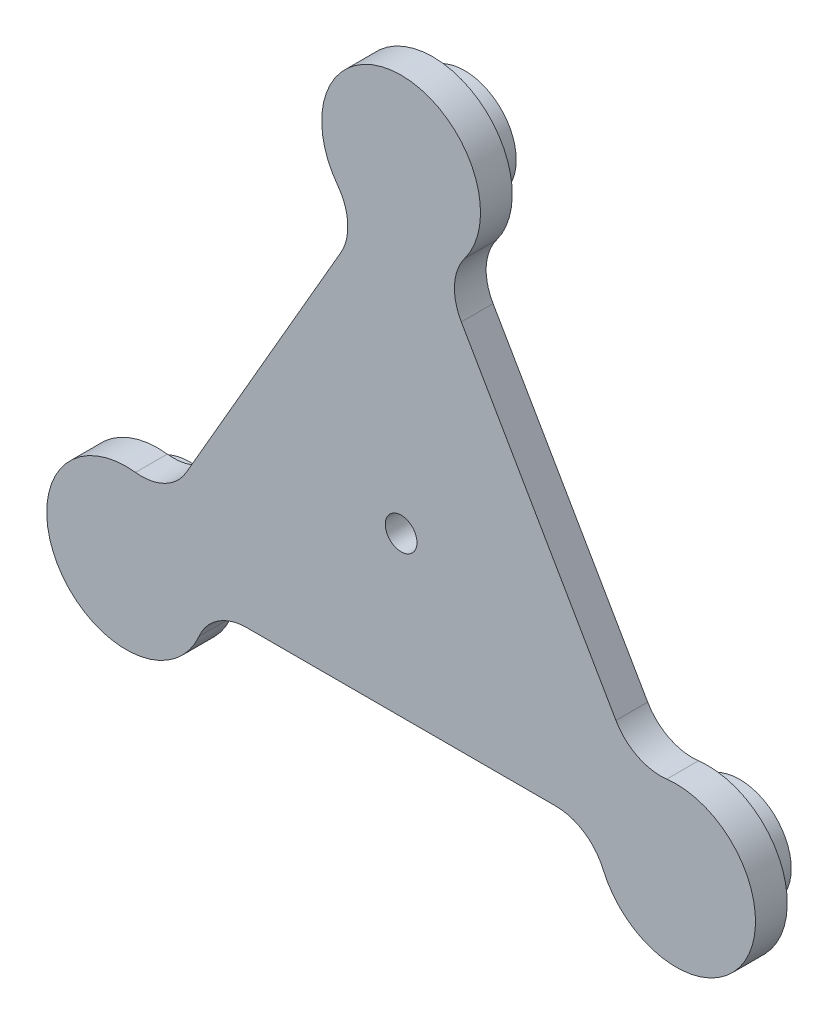
ISO-10303-21;
HEADER;
FILE_DESCRIPTION(('STEP AP214'),'2;1');
FILE_NAME('part.step','',(''),(''),'','','');
FILE_SCHEMA(('AUTOMOTIVE_DESIGN { 1 0 10303 214 1 1 1 1 }'));
ENDSEC;
DATA;
#1=APPLICATION_CONTEXT('core data for automotive mechanical design processes');
#2=APPLICATION_PROTOCOL_DEFINITION('international standard','automotive_design',2000,#1);
#3=PRODUCT_CONTEXT('',#1,'mechanical');
#4=PRODUCT('Part','Part','',(#3));
#5=PRODUCT_RELATED_PRODUCT_CATEGORY('part','',(#4));
#6=PRODUCT_DEFINITION_FORMATION('','',#4);
#7=PRODUCT_DEFINITION_CONTEXT('part definition',#1,'design');
#8=PRODUCT_DEFINITION('design','',#6,#7);
#9=PRODUCT_DEFINITION_SHAPE('','',#8);
#10=(LENGTH_UNIT() NAMED_UNIT(*) SI_UNIT(.MILLI.,.METRE.));
#11=(NAMED_UNIT(*) PLANE_ANGLE_UNIT() SI_UNIT($,.RADIAN.));
#12=(NAMED_UNIT(*) SI_UNIT($,.STERADIAN.) SOLID_ANGLE_UNIT());
#13=UNCERTAINTY_MEASURE_WITH_UNIT(LENGTH_MEASURE(1.E-05),#10,'distance_accuracy_value','');
#14=(GEOMETRIC_REPRESENTATION_CONTEXT(3) GLOBAL_UNCERTAINTY_ASSIGNED_CONTEXT((#13)) GLOBAL_UNIT_ASSIGNED_CONTEXT((#10,
#11,#12)) REPRESENTATION_CONTEXT('',''));
#15=CARTESIAN_POINT('',(0.,0.,0.));
#16=DIRECTION('',(0.,0.,1.));
#17=DIRECTION('',(1.,0.,0.));
#18=AXIS2_PLACEMENT_3D('',#15,#16,#17);
#19=CARTESIAN_POINT('',(33.0301166221257,75.290144521312,-10.));
#20=DIRECTION('',(0.,0.,1.));
#21=DIRECTION('',(1.,0.,0.));
#22=AXIS2_PLACEMENT_3D('',#19,#20,#21);
#23=CYLINDRICAL_SURFACE('',#22,16.2500000000001);
#24=CARTESIAN_POINT('',(33.0301166221257,75.290144521312,0.));
#25=DIRECTION('',(0.,0.,1.));
#26=DIRECTION('',(1.,0.,0.));
#27=AXIS2_PLACEMENT_3D('',#24,#25,#26);
#28=CIRCLE('',#27,16.2500000000001);
#29=CARTESIAN_POINT('',(20.0182604515873,85.0243162373454,0.));
#30=VERTEX_POINT('',#29);
#31=CARTESIAN_POINT('',(18.9572021702539,67.1651473625248,0.));
#32=VERTEX_POINT('',#31);
#33=EDGE_CURVE('E152',#30,#32,#28,.T.);
#34=ORIENTED_EDGE('',*,*,#33,.T.);
#35=DIRECTION('',(0.,0.,1.));
#36=VECTOR('',#35,1.);
#37=CARTESIAN_POINT('',(18.9572021702539,67.1651473625248,-10.));
#38=LINE('',#37,#36);
#39=CARTESIAN_POINT('',(18.9572021702539,67.1651473625248,-10.));
#40=VERTEX_POINT('',#39);
#41=EDGE_CURVE('E201',#40,#32,#38,.T.);
#42=ORIENTED_EDGE('',*,*,#41,.F.);
#43=CARTESIAN_POINT('',(33.0301166221257,75.290144521312,-10.));
#44=DIRECTION('',(0.,0.,1.));
#45=DIRECTION('',(1.,0.,0.));
#46=AXIS2_PLACEMENT_3D('',#43,#44,#45);
#47=CIRCLE('',#46,16.2500000000001);
#48=CARTESIAN_POINT('',(20.0182604515873,85.0243162373454,-10.));
#49=VERTEX_POINT('',#48);
#50=EDGE_CURVE('E180',#49,#40,#47,.T.);
#51=ORIENTED_EDGE('',*,*,#50,.F.);
#52=DIRECTION('',(0.,0.,1.));
#53=VECTOR('',#52,1.);
#54=CARTESIAN_POINT('',(20.0182604515873,85.0243162373454,-10.));
#55=LINE('',#54,#53);
#56=EDGE_CURVE('E148',#49,#30,#55,.T.);
#57=ORIENTED_EDGE('',*,*,#56,.T.);
#58=EDGE_LOOP('',(#34,#42,#51,#57));
#59=FACE_BOUND('',#58,.T.);
#60=ADVANCED_FACE('F32',(#59),#23,.F.);
#61=CARTESIAN_POINT('',(18.9572021702539,67.1651473625248,-10.));
#62=DIRECTION('',(-0.866025504730565,-0.499999825156139,0.));
#63=DIRECTION('',(0.499999825156139,-0.866025504730565,0.));
#64=AXIS2_PLACEMENT_3D('',#61,#62,#63);
#65=PLANE('',#64);
#66=DIRECTION('',(0.499999825156139,-0.866025504730565,0.));
#67=VECTOR('',#66,1.);
#68=CARTESIAN_POINT('',(18.9572021702539,67.1651473625248,0.));
#69=LINE('',#68,#67);
#70=CARTESIAN_POINT('',(67.6453180189673,-17.1651823312806,0.));
#71=VERTEX_POINT('',#70);
#72=EDGE_CURVE('E155',#32,#71,#69,.T.);
#73=ORIENTED_EDGE('',*,*,#72,.T.);
#74=DIRECTION('',(0.,0.,1.));
#75=VECTOR('',#74,1.);
#76=CARTESIAN_POINT('',(67.6453180189673,-17.1651823312806,-10.));
#77=LINE('',#76,#75);
#78=CARTESIAN_POINT('',(67.6453180189673,-17.1651823312806,-10.));
#79=VERTEX_POINT('',#78);
#80=EDGE_CURVE('E199',#79,#71,#77,.T.);
#81=ORIENTED_EDGE('',*,*,#80,.F.);
#82=DIRECTION('',(0.499999825156139,-0.866025504730565,0.));
#83=VECTOR('',#82,1.);
#84=CARTESIAN_POINT('',(18.9572021702539,67.1651473625248,-10.));
#85=LINE('',#84,#83);
#86=EDGE_CURVE('E100',#40,#79,#85,.T.);
#87=ORIENTED_EDGE('',*,*,#86,.F.);
#88=ORIENTED_EDGE('',*,*,#41,.T.);
#89=EDGE_LOOP('',(#73,#81,#87,#88));
#90=FACE_BOUND('',#89,.T.);
#91=ADVANCED_FACE('F233',(#90),#65,.F.);
#92=CARTESIAN_POINT('',(81.7182324708391,-9.04018517249335,-10.));
#93=DIRECTION('',(0.,0.,1.));
#94=DIRECTION('',(1.,0.,0.));
#95=AXIS2_PLACEMENT_3D('',#92,#93,#94);
#96=CYLINDRICAL_SURFACE('',#95,16.2500000000001);
#97=CARTESIAN_POINT('',(81.7182324708391,-9.04018517249335,0.));
#98=DIRECTION('',(0.,0.,-1.));
#99=DIRECTION('',(-1.,0.,0.));
#100=AXIS2_PLACEMENT_3D('',#97,#98,#99);
#101=CIRCLE('',#100,16.2500000000001);
#102=CARTESIAN_POINT('',(83.6423378611152,-25.1758698015109,0.));
#103=VERTEX_POINT('',#102);
#104=EDGE_CURVE('E159',#103,#71,#101,.T.);
#105=ORIENTED_EDGE('',*,*,#104,.F.);
#106=DIRECTION('',(0.,0.,1.));
#107=VECTOR('',#106,1.);
#108=CARTESIAN_POINT('',(83.6423378611152,-25.1758698015109,-10.));
#109=LINE('',#108,#107);
#110=CARTESIAN_POINT('',(83.6423378611152,-25.1758698015109,-10.));
#111=VERTEX_POINT('',#110);
#112=EDGE_CURVE('E197',#111,#103,#109,.T.);
#113=ORIENTED_EDGE('',*,*,#112,.F.);
#114=CARTESIAN_POINT('',(81.7182324708391,-9.04018517249335,-10.));
#115=DIRECTION('',(0.,0.,-1.));
#116=DIRECTION('',(-1.,0.,0.));
#117=AXIS2_PLACEMENT_3D('',#114,#115,#116);
#118=CIRCLE('',#117,16.2500000000001);
#119=EDGE_CURVE('E248',#111,#79,#118,.T.);
#120=ORIENTED_EDGE('',*,*,#119,.T.);
#121=ORIENTED_EDGE('',*,*,#80,.T.);
#122=EDGE_LOOP('',(#105,#113,#120,#121));
#123=FACE_BOUND('',#122,.T.);
#124=ADVANCED_FACE('F238',(#123),#96,.F.);
#125=CARTESIAN_POINT('',(86.6025000000018,-49.9999999999995,-10.));
#126=DIRECTION('',(0.,0.,1.));
#127=DIRECTION('',(1.,0.,0.));
#128=AXIS2_PLACEMENT_3D('',#125,#126,#127);
#129=CYLINDRICAL_SURFACE('',#128,25.0000000000002);
#130=CARTESIAN_POINT('',(86.6025000000018,-49.9999999999995,0.));
#131=DIRECTION('',(0.,0.,-1.));
#132=DIRECTION('',(-1.,0.,0.));
#133=AXIS2_PLACEMENT_3D('',#130,#131,#132);
#134=CIRCLE('',#133,25.0000000000002);
#135=CARTESIAN_POINT('',(63.6240875751492,-59.8484802093207,0.));
#136=VERTEX_POINT('',#135);
#137=EDGE_CURVE('E162',#103,#136,#134,.T.);
#138=ORIENTED_EDGE('',*,*,#137,.T.);
#139=DIRECTION('',(0.,0.,1.));
#140=VECTOR('',#139,1.);
#141=CARTESIAN_POINT('',(63.6240875751492,-59.8484802093207,-10.));
#142=LINE('',#141,#140);
#143=CARTESIAN_POINT('',(63.6240875751492,-59.8484802093207,-10.));
#144=VERTEX_POINT('',#143);
#145=EDGE_CURVE('E194',#144,#136,#142,.T.);
#146=ORIENTED_EDGE('',*,*,#145,.F.);
#147=CARTESIAN_POINT('',(86.6025000000018,-49.9999999999995,-10.));
#148=DIRECTION('',(0.,0.,-1.));
#149=DIRECTION('',(-1.,0.,0.));
#150=AXIS2_PLACEMENT_3D('',#147,#148,#149);
#151=CIRCLE('',#150,25.0000000000002);
#152=EDGE_CURVE('E250',#111,#144,#151,.T.);
#153=ORIENTED_EDGE('',*,*,#152,.F.);
#154=ORIENTED_EDGE('',*,*,#112,.T.);
#155=EDGE_LOOP('',(#138,#146,#153,#154));
#156=FACE_BOUND('',#155,.T.);
#157=ADVANCED_FACE('F288',(#156),#129,.T.);
#158=CARTESIAN_POINT('',(48.6881194989951,-66.2499923453796,-10.));
#159=DIRECTION('',(0.,0.,1.));
#160=DIRECTION('',(1.,0.,0.));
#161=AXIS2_PLACEMENT_3D('',#158,#159,#160);
#162=CYLINDRICAL_SURFACE('',#161,16.2500000000005);
#163=CARTESIAN_POINT('',(48.6881194989951,-66.2499923453796,0.));
#164=DIRECTION('',(0.,0.,1.));
#165=DIRECTION('',(1.,0.,0.));
#166=AXIS2_PLACEMENT_3D('',#163,#164,#165);
#167=CIRCLE('',#166,16.2500000000005);
#168=CARTESIAN_POINT('',(48.6881227797448,-49.9999923453794,0.));
#169=VERTEX_POINT('',#168);
#170=EDGE_CURVE('E164',#136,#169,#167,.T.);
#171=ORIENTED_EDGE('',*,*,#170,.T.);
#172=DIRECTION('',(0.,0.,1.));
#173=VECTOR('',#172,1.);
#174=CARTESIAN_POINT('',(48.6881227797448,-49.9999923453794,-10.));
#175=LINE('',#174,#173);
#176=CARTESIAN_POINT('',(48.6881227797448,-49.9999923453794,-10.));
#177=VERTEX_POINT('',#176);
#178=EDGE_CURVE('E191',#177,#169,#175,.T.);
#179=ORIENTED_EDGE('',*,*,#178,.F.);
#180=CARTESIAN_POINT('',(48.6881194989951,-66.2499923453796,-10.));
#181=DIRECTION('',(0.,0.,1.));
#182=DIRECTION('',(1.,0.,0.));
#183=AXIS2_PLACEMENT_3D('',#180,#181,#182);
#184=CIRCLE('',#183,16.2500000000005);
#185=EDGE_CURVE('E252',#144,#177,#184,.T.);
#186=ORIENTED_EDGE('',*,*,#185,.F.);
#187=ORIENTED_EDGE('',*,*,#145,.T.);
#188=EDGE_LOOP('',(#171,#179,#186,#187));
#189=FACE_BOUND('',#188,.T.);
#190=ADVANCED_FACE('F284',(#189),#162,.F.);
#191=CARTESIAN_POINT('',(48.6881227797448,-49.9999923453791,-10.));
#192=DIRECTION('',(2.01892290155727E-07,0.99999999999998,0.));
#193=DIRECTION('',(-0.99999999999998,2.01892290155727E-07,0.));
#194=AXIS2_PLACEMENT_3D('',#191,#192,#193);
#195=PLANE('',#194);
#196=DIRECTION('',(-0.99999999999998,2.01892290155727E-07,0.));
#197=VECTOR('',#196,1.);
#198=CARTESIAN_POINT('',(48.6881227797448,-49.9999923453791,0.));
#199=LINE('',#198,#197);
#200=CARTESIAN_POINT('',(-48.6881429689648,-49.9999726858618,0.));
#201=VERTEX_POINT('',#200);
#202=EDGE_CURVE('E166',#169,#201,#199,.T.);
#203=ORIENTED_EDGE('',*,*,#202,.T.);
#204=DIRECTION('',(0.,0.,1.));
#205=VECTOR('',#204,1.);
#206=CARTESIAN_POINT('',(-48.6881429689648,-49.9999726858618,-10.));
#207=LINE('',#206,#205);
#208=CARTESIAN_POINT('',(-48.6881429689648,-49.9999726858618,-10.));
#209=VERTEX_POINT('',#208);
#210=EDGE_CURVE('E189',#209,#201,#207,.T.);
#211=ORIENTED_EDGE('',*,*,#210,.F.);
#212=DIRECTION('',(-0.99999999999998,2.01892290155727E-07,0.));
#213=VECTOR('',#212,1.);
#214=CARTESIAN_POINT('',(48.6881227797448,-49.9999923453791,-10.));
#215=LINE('',#214,#213);
#216=EDGE_CURVE('E258',#177,#209,#215,.T.);
#217=ORIENTED_EDGE('',*,*,#216,.F.);
#218=ORIENTED_EDGE('',*,*,#178,.T.);
#219=EDGE_LOOP('',(#203,#211,#217,#218));
#220=FACE_BOUND('',#219,.T.);
#221=ADVANCED_FACE('F280',(#220),#195,.F.);
#222=CARTESIAN_POINT('',(-48.6881462497149,-66.2499726858624,-10.));
#223=DIRECTION('',(0.,0.,1.));
#224=DIRECTION('',(1.,0.,0.));
#225=AXIS2_PLACEMENT_3D('',#222,#223,#224);
#226=CYLINDRICAL_SURFACE('',#225,16.2500000000002);
#227=CARTESIAN_POINT('',(-48.6881462497149,-66.2499726858624,0.));
#228=DIRECTION('',(0.,0.,-1.));
#229=DIRECTION('',(-1.,0.,0.));
#230=AXIS2_PLACEMENT_3D('',#227,#228,#229);
#231=CIRCLE('',#230,16.2500000000002);
#232=CARTESIAN_POINT('',(-63.6241117410363,-59.8484545188911,0.));
#233=VERTEX_POINT('',#232);
#234=EDGE_CURVE('E169',#233,#201,#231,.T.);
#235=ORIENTED_EDGE('',*,*,#234,.F.);
#236=DIRECTION('',(0.,0.,1.));
#237=VECTOR('',#236,1.);
#238=CARTESIAN_POINT('',(-63.6241117410363,-59.8484545188911,-10.));
#239=LINE('',#238,#237);
#240=CARTESIAN_POINT('',(-63.6241117410363,-59.8484545188911,-10.));
#241=VERTEX_POINT('',#240);
#242=EDGE_CURVE('E187',#241,#233,#239,.T.);
#243=ORIENTED_EDGE('',*,*,#242,.F.);
#244=CARTESIAN_POINT('',(-48.6881462497149,-66.2499726858624,-10.));
#245=DIRECTION('',(0.,0.,-1.));
#246=DIRECTION('',(-1.,0.,0.));
#247=AXIS2_PLACEMENT_3D('',#244,#245,#246);
#248=CIRCLE('',#247,16.2500000000002);
#249=EDGE_CURVE('E260',#241,#209,#248,.T.);
#250=ORIENTED_EDGE('',*,*,#249,.T.);
#251=ORIENTED_EDGE('',*,*,#210,.T.);
#252=EDGE_LOOP('',(#235,#243,#250,#251));
#253=FACE_BOUND('',#252,.T.);
#254=ADVANCED_FACE('F276',(#253),#226,.F.);
#255=CARTESIAN_POINT('',(-86.6025201892225,-49.9999650312423,-10.));
#256=DIRECTION('',(0.,0.,1.));
#257=DIRECTION('',(1.,0.,0.));
#258=AXIS2_PLACEMENT_3D('',#255,#256,#257);
#259=CYLINDRICAL_SURFACE('',#258,24.9999999999998);
#260=CARTESIAN_POINT('',(-86.6025201892225,-49.9999650312423,0.));
#261=DIRECTION('',(0.,0.,-1.));
#262=DIRECTION('',(-1.,0.,0.));
#263=AXIS2_PLACEMENT_3D('',#260,#261,#262);
#264=CIRCLE('',#263,24.9999999999998);
#265=CARTESIAN_POINT('',(-83.6423480267364,-25.1758360280238,0.));
#266=VERTEX_POINT('',#265);
#267=EDGE_CURVE('E172',#233,#266,#264,.T.);
#268=ORIENTED_EDGE('',*,*,#267,.T.);
#269=DIRECTION('',(0.,0.,1.));
#270=VECTOR('',#269,1.);
#271=CARTESIAN_POINT('',(-83.6423480267364,-25.1758360280238,-10.));
#272=LINE('',#271,#270);
#273=CARTESIAN_POINT('',(-83.6423480267364,-25.1758360280238,-10.));
#274=VERTEX_POINT('',#273);
#275=EDGE_CURVE('E184',#274,#266,#272,.T.);
#276=ORIENTED_EDGE('',*,*,#275,.F.);
#277=CARTESIAN_POINT('',(-86.6025201892225,-49.9999650312423,-10.));
#278=DIRECTION('',(0.,0.,-1.));
#279=DIRECTION('',(-1.,0.,0.));
#280=AXIS2_PLACEMENT_3D('',#277,#278,#279);
#281=CIRCLE('',#280,24.9999999999998);
#282=EDGE_CURVE('E263',#241,#274,#281,.T.);
#283=ORIENTED_EDGE('',*,*,#282,.F.);
#284=ORIENTED_EDGE('',*,*,#242,.T.);
#285=EDGE_LOOP('',(#268,#276,#283,#284));
#286=FACE_BOUND('',#285,.T.);
#287=ADVANCED_FACE('F268',(#286),#259,.T.);
#288=CARTESIAN_POINT('',(-81.7182361211202,-9.04015217593124,-10.));
#289=DIRECTION('',(0.,0.,1.));
#290=DIRECTION('',(1.,0.,0.));
#291=AXIS2_PLACEMENT_3D('',#288,#289,#290);
#292=CYLINDRICAL_SURFACE('',#291,16.2500000000008);
#293=CARTESIAN_POINT('',(-81.7182361211202,-9.04015217593124,0.));
#294=DIRECTION('',(0.,0.,1.));
#295=DIRECTION('',(1.,0.,0.));
#296=AXIS2_PLACEMENT_3D('',#293,#294,#295);
#297=CIRCLE('',#296,16.2500000000008);
#298=CARTESIAN_POINT('',(-67.6453249499983,-17.1651550171453,0.));
#299=VERTEX_POINT('',#298);
#300=EDGE_CURVE('E174',#266,#299,#297,.T.);
#301=ORIENTED_EDGE('',*,*,#300,.T.);
#302=DIRECTION('',(0.,0.,1.));
#303=VECTOR('',#302,1.);
#304=CARTESIAN_POINT('',(-67.6453249499983,-17.1651550171453,-10.));
#305=LINE('',#304,#303);
#306=CARTESIAN_POINT('',(-67.6453249499983,-17.1651550171453,-10.));
#307=VERTEX_POINT('',#306);
#308=EDGE_CURVE('E144',#307,#299,#305,.T.);
#309=ORIENTED_EDGE('',*,*,#308,.F.);
#310=CARTESIAN_POINT('',(-81.7182361211202,-9.04015217593124,-10.));
#311=DIRECTION('',(0.,0.,1.));
#312=DIRECTION('',(1.,0.,0.));
#313=AXIS2_PLACEMENT_3D('',#310,#311,#312);
#314=CIRCLE('',#313,16.2500000000008);
#315=EDGE_CURVE('E131',#274,#307,#314,.T.);
#316=ORIENTED_EDGE('',*,*,#315,.F.);
#317=ORIENTED_EDGE('',*,*,#275,.T.);
#318=EDGE_LOOP('',(#301,#309,#316,#317));
#319=FACE_BOUND('',#318,.T.);
#320=ADVANCED_FACE('F272',(#319),#292,.F.);
#321=CARTESIAN_POINT('',(-67.6453249499989,-17.165155017145,-10.));
#322=DIRECTION('',(0.866025302838276,-0.500000174843842,0.));
#323=DIRECTION('',(0.500000174843842,0.866025302838276,0.));
#324=AXIS2_PLACEMENT_3D('',#321,#322,#323);
#325=PLANE('',#324);
#326=DIRECTION('',(0.500000174843842,0.866025302838276,0.));
#327=VECTOR('',#326,1.);
#328=CARTESIAN_POINT('',(-67.6453249499989,-17.165155017145,0.));
#329=LINE('',#328,#327);
#330=CARTESIAN_POINT('',(-18.9571750500028,67.1651550171431,0.));
#331=VERTEX_POINT('',#330);
#332=EDGE_CURVE('E140',#299,#331,#329,.T.);
#333=ORIENTED_EDGE('',*,*,#332,.T.);
#334=DIRECTION('',(0.,0.,1.));
#335=VECTOR('',#334,1.);
#336=CARTESIAN_POINT('',(-18.9571750500028,67.1651550171431,-10.));
#337=LINE('',#336,#335);
#338=CARTESIAN_POINT('',(-18.9571750500028,67.1651550171431,-10.));
#339=VERTEX_POINT('',#338);
#340=EDGE_CURVE('E137',#339,#331,#337,.T.);
#341=ORIENTED_EDGE('',*,*,#340,.F.);
#342=DIRECTION('',(0.500000174843842,0.866025302838276,0.));
#343=VECTOR('',#342,1.);
#344=CARTESIAN_POINT('',(-67.6453249499989,-17.165155017145,-10.));
#345=LINE('',#344,#343);
#346=EDGE_CURVE('E125',#307,#339,#345,.T.);
#347=ORIENTED_EDGE('',*,*,#346,.F.);
#348=ORIENTED_EDGE('',*,*,#308,.T.);
#349=EDGE_LOOP('',(#333,#341,#347,#348));
#350=FACE_BOUND('',#349,.T.);
#351=ADVANCED_FACE('F138',(#350),#325,.F.);
#352=CARTESIAN_POINT('',(-33.0300862211249,75.2901578583558,-10.));
#353=DIRECTION('',(0.,0.,1.));
#354=DIRECTION('',(1.,0.,0.));
#355=AXIS2_PLACEMENT_3D('',#352,#353,#354);
#356=CYLINDRICAL_SURFACE('',#355,16.2500000000001);
#357=CARTESIAN_POINT('',(-33.0300862211249,75.2901578583558,0.));
#358=DIRECTION('',(0.,0.,-1.));
#359=DIRECTION('',(-1.,0.,0.));
#360=AXIS2_PLACEMENT_3D('',#357,#358,#359);
#361=CIRCLE('',#360,16.2500000000001);
#362=CARTESIAN_POINT('',(-20.0182261200797,85.0243243204023,0.));
#363=VERTEX_POINT('',#362);
#364=EDGE_CURVE('E177',#363,#331,#361,.T.);
#365=ORIENTED_EDGE('',*,*,#364,.F.);
#366=DIRECTION('',(0.,0.,1.));
#367=VECTOR('',#366,1.);
#368=CARTESIAN_POINT('',(-20.0182261200797,85.0243243204023,-10.));
#369=LINE('',#368,#367);
#370=CARTESIAN_POINT('',(-20.0182261200797,85.0243243204023,-10.));
#371=VERTEX_POINT('',#370);
#372=EDGE_CURVE('E88',#371,#363,#369,.T.);
#373=ORIENTED_EDGE('',*,*,#372,.F.);
#374=CARTESIAN_POINT('',(-33.0300862211249,75.2901578583558,-10.));
#375=DIRECTION('',(0.,0.,-1.));
#376=DIRECTION('',(-1.,0.,0.));
#377=AXIS2_PLACEMENT_3D('',#374,#375,#376);
#378=CIRCLE('',#377,16.2500000000001);
#379=EDGE_CURVE('E129',#371,#339,#378,.T.);
#380=ORIENTED_EDGE('',*,*,#379,.T.);
#381=ORIENTED_EDGE('',*,*,#340,.T.);
#382=EDGE_LOOP('',(#365,#373,#380,#381));
#383=FACE_BOUND('',#382,.T.);
#384=ADVANCED_FACE('F146',(#383),#356,.F.);
#385=CARTESIAN_POINT('',(2.01892205930684E-05,99.9999650312431,-10.));
#386=DIRECTION('',(0.,0.,1.));
#387=DIRECTION('',(1.,0.,0.));
#388=AXIS2_PLACEMENT_3D('',#385,#386,#387);
#389=CYLINDRICAL_SURFACE('',#388,25.0000000000001);
#390=CARTESIAN_POINT('',(2.01892205930684E-05,99.9999650312431,0.));
#391=DIRECTION('',(0.,0.,-1.));
#392=DIRECTION('',(-1.,0.,0.));
#393=AXIS2_PLACEMENT_3D('',#390,#391,#392);
#394=CIRCLE('',#393,25.0000000000001);
#395=EDGE_CURVE('E91',#363,#30,#394,.T.);
#396=ORIENTED_EDGE('',*,*,#395,.T.);
#397=ORIENTED_EDGE('',*,*,#56,.F.);
#398=CARTESIAN_POINT('',(2.01892205930684E-05,99.9999650312431,-10.));
#399=DIRECTION('',(0.,0.,-1.));
#400=DIRECTION('',(-1.,0.,0.));
#401=AXIS2_PLACEMENT_3D('',#398,#399,#400);
#402=CIRCLE('',#401,25.0000000000001);
#403=EDGE_CURVE('E48',#371,#49,#402,.T.);
#404=ORIENTED_EDGE('',*,*,#403,.F.);
#405=ORIENTED_EDGE('',*,*,#372,.T.);
#406=EDGE_LOOP('',(#396,#397,#404,#405));
#407=FACE_BOUND('',#406,.T.);
#408=ADVANCED_FACE('F213',(#407),#389,.T.);
#409=CARTESIAN_POINT('',(33.0301166221257,75.290144521312,-10.));
#410=DIRECTION('',(0.,0.,1.));
#411=DIRECTION('',(1.,0.,0.));
#412=AXIS2_PLACEMENT_3D('',#409,#410,#411);
#413=PLANE('',#412);
#414=CARTESIAN_POINT('',(0.,0.,-10.));
#415=DIRECTION('',(0.,0.,1.));
#416=DIRECTION('',(1.,0.,0.));
#417=AXIS2_PLACEMENT_3D('',#414,#415,#416);
#418=CIRCLE('',#417,5.);
#419=CARTESIAN_POINT('',(5.,0.,-10.));
#420=VERTEX_POINT('',#419);
#421=EDGE_CURVE('E394',#420,#420,#418,.T.);
#422=ORIENTED_EDGE('',*,*,#421,.T.);
#423=EDGE_LOOP('',(#422));
#424=FACE_BOUND('',#423,.T.);
#425=CARTESIAN_POINT('',(-86.6025201892224,-49.9999650312363,-10.));
#426=DIRECTION('',(0.,0.,1.));
#427=DIRECTION('',(1.,0.,0.));
#428=AXIS2_PLACEMENT_3D('',#425,#426,#427);
#429=CIRCLE('',#428,16.2500000000052);
#430=CARTESIAN_POINT('',(-70.3525201892173,-49.9999650312363,-10.));
#431=VERTEX_POINT('',#430);
#432=EDGE_CURVE('E11',#431,#431,#429,.F.);
#433=ORIENTED_EDGE('',*,*,#432,.F.);
#434=EDGE_LOOP('',(#433));
#435=FACE_BOUND('',#434,.T.);
#436=CARTESIAN_POINT('',(2.01892269262759E-05,99.9999650312468,-10.));
#437=DIRECTION('',(0.,0.,1.));
#438=DIRECTION('',(1.,0.,0.));
#439=AXIS2_PLACEMENT_3D('',#436,#437,#438);
#440=CIRCLE('',#439,16.249999999998);
#441=CARTESIAN_POINT('',(16.2500201892249,99.9999650312468,-10.));
#442=VERTEX_POINT('',#441);
#443=EDGE_CURVE('E40',#442,#442,#440,.F.);
#444=ORIENTED_EDGE('',*,*,#443,.F.);
#445=EDGE_LOOP('',(#444));
#446=FACE_BOUND('',#445,.T.);
#447=CARTESIAN_POINT('',(86.6025000000017,-49.9999999999995,-10.));
#448=DIRECTION('',(0.,0.,1.));
#449=DIRECTION('',(1.,0.,0.));
#450=AXIS2_PLACEMENT_3D('',#447,#448,#449);
#451=CIRCLE('',#450,16.25);
#452=CARTESIAN_POINT('',(102.852500000002,-49.9999999999995,-10.));
#453=VERTEX_POINT('',#452);
#454=EDGE_CURVE('E203',#453,#453,#451,.F.);
#455=ORIENTED_EDGE('',*,*,#454,.F.);
#456=EDGE_LOOP('',(#455));
#457=FACE_BOUND('',#456,.T.);
#458=ORIENTED_EDGE('',*,*,#50,.T.);
#459=ORIENTED_EDGE('',*,*,#86,.T.);
#460=ORIENTED_EDGE('',*,*,#119,.F.);
#461=ORIENTED_EDGE('',*,*,#152,.T.);
#462=ORIENTED_EDGE('',*,*,#185,.T.);
#463=ORIENTED_EDGE('',*,*,#216,.T.);
#464=ORIENTED_EDGE('',*,*,#249,.F.);
#465=ORIENTED_EDGE('',*,*,#282,.T.);
#466=ORIENTED_EDGE('',*,*,#315,.T.);
#467=ORIENTED_EDGE('',*,*,#346,.T.);
#468=ORIENTED_EDGE('',*,*,#379,.F.);
#469=ORIENTED_EDGE('',*,*,#403,.T.);
#470=EDGE_LOOP('',(#458,#459,#460,#461,#462,#463,#464,#465,#466,#467,#468,#469));
#471=FACE_BOUND('',#470,.T.);
#472=ADVANCED_FACE('F127',(#424,#435,#446,#457,#471),#413,.F.);
#473=CARTESIAN_POINT('',(33.0301166221257,75.290144521312,0.));
#474=DIRECTION('',(0.,0.,1.));
#475=DIRECTION('',(1.,0.,0.));
#476=AXIS2_PLACEMENT_3D('',#473,#474,#475);
#477=PLANE('',#476);
#478=CARTESIAN_POINT('',(0.,0.,0.));
#479=DIRECTION('',(0.,0.,1.));
#480=DIRECTION('',(1.,0.,0.));
#481=AXIS2_PLACEMENT_3D('',#478,#479,#480);
#482=CIRCLE('',#481,5.);
#483=CARTESIAN_POINT('',(5.,0.,0.));
#484=VERTEX_POINT('',#483);
#485=EDGE_CURVE('E397',#484,#484,#482,.T.);
#486=ORIENTED_EDGE('',*,*,#485,.F.);
#487=EDGE_LOOP('',(#486));
#488=FACE_BOUND('',#487,.T.);
#489=ORIENTED_EDGE('',*,*,#33,.F.);
#490=ORIENTED_EDGE('',*,*,#395,.F.);
#491=ORIENTED_EDGE('',*,*,#364,.T.);
#492=ORIENTED_EDGE('',*,*,#332,.F.);
#493=ORIENTED_EDGE('',*,*,#300,.F.);
#494=ORIENTED_EDGE('',*,*,#267,.F.);
#495=ORIENTED_EDGE('',*,*,#234,.T.);
#496=ORIENTED_EDGE('',*,*,#202,.F.);
#497=ORIENTED_EDGE('',*,*,#170,.F.);
#498=ORIENTED_EDGE('',*,*,#137,.F.);
#499=ORIENTED_EDGE('',*,*,#104,.T.);
#500=ORIENTED_EDGE('',*,*,#72,.F.);
#501=EDGE_LOOP('',(#489,#490,#491,#492,#493,#494,#495,#496,#497,#498,#499,#500));
#502=FACE_BOUND('',#501,.T.);
#503=ADVANCED_FACE('F212',(#488,#502),#477,.T.);
#504=CARTESIAN_POINT('',(86.6025000000017,-49.9999999999995,-20.));
#505=DIRECTION('',(0.,0.,1.));
#506=DIRECTION('',(1.,0.,0.));
#507=AXIS2_PLACEMENT_3D('',#504,#505,#506);
#508=CYLINDRICAL_SURFACE('',#507,16.25);
#509=CARTESIAN_POINT('',(86.6025000000017,-49.9999999999995,-20.));
#510=DIRECTION('',(0.,0.,-1.));
#511=DIRECTION('',(-1.,0.,0.));
#512=AXIS2_PLACEMENT_3D('',#509,#510,#511);
#513=CIRCLE('',#512,16.25);
#514=CARTESIAN_POINT('',(70.3525000000017,-49.9999999999995,-20.));
#515=VERTEX_POINT('',#514);
#516=EDGE_CURVE('E156',#515,#515,#513,.T.);
#517=ORIENTED_EDGE('',*,*,#516,.F.);
#518=EDGE_LOOP('',(#517));
#519=FACE_BOUND('',#518,.T.);
#520=ORIENTED_EDGE('',*,*,#454,.T.);
#521=EDGE_LOOP('',(#520));
#522=FACE_BOUND('',#521,.T.);
#523=ADVANCED_FACE('F218',(#519,#522),#508,.T.);
#524=CARTESIAN_POINT('',(86.6025000000017,-49.9999999999995,-20.));
#525=DIRECTION('',(0.,0.,-1.));
#526=DIRECTION('',(-1.,0.,0.));
#527=AXIS2_PLACEMENT_3D('',#524,#525,#526);
#528=PLANE('',#527);
#529=ORIENTED_EDGE('',*,*,#516,.T.);
#530=EDGE_LOOP('',(#529));
#531=FACE_BOUND('',#530,.T.);
#532=ADVANCED_FACE('F220',(#531),#528,.T.);
#533=CARTESIAN_POINT('',(2.01892269262759E-05,99.9999650312468,-20.));
#534=DIRECTION('',(0.,0.,1.));
#535=DIRECTION('',(1.,0.,0.));
#536=AXIS2_PLACEMENT_3D('',#533,#534,#535);
#537=CYLINDRICAL_SURFACE('',#536,16.249999999998);
#538=CARTESIAN_POINT('',(2.01892269262759E-05,99.9999650312468,-20.));
#539=DIRECTION('',(0.,0.,-1.));
#540=DIRECTION('',(-1.,0.,0.));
#541=AXIS2_PLACEMENT_3D('',#538,#539,#540);
#542=CIRCLE('',#541,16.249999999998);
#543=CARTESIAN_POINT('',(-16.249979810771,99.9999650312468,-20.));
#544=VERTEX_POINT('',#543);
#545=EDGE_CURVE('E388',#544,#544,#542,.T.);
#546=ORIENTED_EDGE('',*,*,#545,.F.);
#547=EDGE_LOOP('',(#546));
#548=FACE_BOUND('',#547,.T.);
#549=ORIENTED_EDGE('',*,*,#443,.T.);
#550=EDGE_LOOP('',(#549));
#551=FACE_BOUND('',#550,.T.);
#552=ADVANCED_FACE('F208',(#548,#551),#537,.T.);
#553=CARTESIAN_POINT('',(2.01892269262759E-05,99.9999650312468,-20.));
#554=DIRECTION('',(0.,0.,-1.));
#555=DIRECTION('',(-1.,0.,0.));
#556=AXIS2_PLACEMENT_3D('',#553,#554,#555);
#557=PLANE('',#556);
#558=ORIENTED_EDGE('',*,*,#545,.T.);
#559=EDGE_LOOP('',(#558));
#560=FACE_BOUND('',#559,.T.);
#561=ADVANCED_FACE('F351',(#560),#557,.T.);
#562=CARTESIAN_POINT('',(-86.6025201892224,-49.9999650312363,-20.));
#563=DIRECTION('',(0.,0.,1.));
#564=DIRECTION('',(1.,0.,0.));
#565=AXIS2_PLACEMENT_3D('',#562,#563,#564);
#566=CYLINDRICAL_SURFACE('',#565,16.2500000000052);
#567=CARTESIAN_POINT('',(-86.6025201892224,-49.9999650312363,-20.));
#568=DIRECTION('',(0.,0.,-1.));
#569=DIRECTION('',(-1.,0.,0.));
#570=AXIS2_PLACEMENT_3D('',#567,#568,#569);
#571=CIRCLE('',#570,16.2500000000052);
#572=CARTESIAN_POINT('',(-102.852520189228,-49.9999650312363,-20.));
#573=VERTEX_POINT('',#572);
#574=EDGE_CURVE('E389',#573,#573,#571,.T.);
#575=ORIENTED_EDGE('',*,*,#574,.F.);
#576=EDGE_LOOP('',(#575));
#577=FACE_BOUND('',#576,.T.);
#578=ORIENTED_EDGE('',*,*,#432,.T.);
#579=EDGE_LOOP('',(#578));
#580=FACE_BOUND('',#579,.T.);
#581=ADVANCED_FACE('F344',(#577,#580),#566,.T.);
#582=CARTESIAN_POINT('',(-86.6025201892224,-49.9999650312363,-20.));
#583=DIRECTION('',(0.,0.,-1.));
#584=DIRECTION('',(-1.,0.,0.));
#585=AXIS2_PLACEMENT_3D('',#582,#583,#584);
#586=PLANE('',#585);
#587=ORIENTED_EDGE('',*,*,#574,.T.);
#588=EDGE_LOOP('',(#587));
#589=FACE_BOUND('',#588,.T.);
#590=ADVANCED_FACE('F334',(#589),#586,.T.);
#591=CARTESIAN_POINT('',(0.,0.,-10.));
#592=DIRECTION('',(0.,0.,1.));
#593=DIRECTION('',(1.,0.,0.));
#594=AXIS2_PLACEMENT_3D('',#591,#592,#593);
#595=CYLINDRICAL_SURFACE('',#594,5.);
#596=ORIENTED_EDGE('',*,*,#421,.F.);
#597=EDGE_LOOP('',(#596));
#598=FACE_BOUND('',#597,.T.);
#599=ORIENTED_EDGE('',*,*,#485,.T.);
#600=EDGE_LOOP('',(#599));
#601=FACE_BOUND('',#600,.T.);
#602=ADVANCED_FACE('F330',(#598,#601),#595,.F.);
#603=CLOSED_SHELL('',(#60,#91,#124,#157,#190,#221,#254,#287,#320,#351,#384,#408,#472,#503,#523,
#532,#552,#561,#581,#590,#602));
#604=MANIFOLD_SOLID_BREP('B2',#603);
#605=ADVANCED_BREP_SHAPE_REPRESENTATION('',(#18,#604),#14);
#606=SHAPE_DEFINITION_REPRESENTATION(#9,#605);
ENDSEC;
END-ISO-10303-21;
